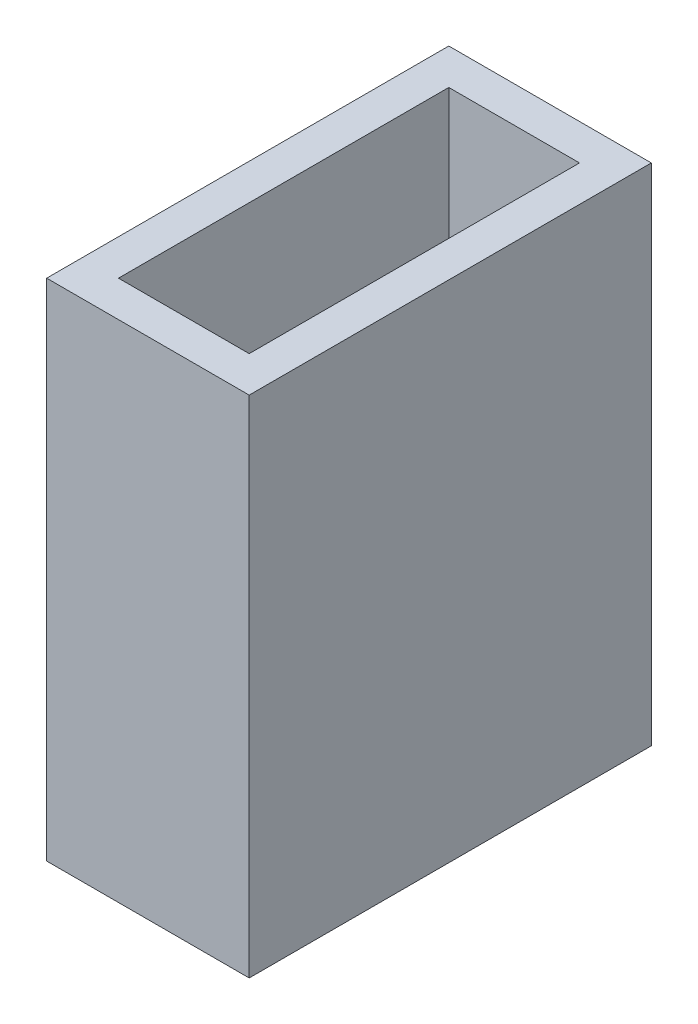
ISO-10303-21;
HEADER;
FILE_DESCRIPTION(('STEP AP214'),'2;1');
FILE_NAME('part.step','',(''),(''),'','','');
FILE_SCHEMA(('AUTOMOTIVE_DESIGN { 1 0 10303 214 1 1 1 1 }'));
ENDSEC;
DATA;
#1=APPLICATION_CONTEXT('core data for automotive mechanical design processes');
#2=APPLICATION_PROTOCOL_DEFINITION('international standard','automotive_design',2000,#1);
#3=PRODUCT_CONTEXT('',#1,'mechanical');
#4=PRODUCT('Part','Part','',(#3));
#5=PRODUCT_RELATED_PRODUCT_CATEGORY('part','',(#4));
#6=PRODUCT_DEFINITION_FORMATION('','',#4);
#7=PRODUCT_DEFINITION_CONTEXT('part definition',#1,'design');
#8=PRODUCT_DEFINITION('design','',#6,#7);
#9=PRODUCT_DEFINITION_SHAPE('','',#8);
#10=(LENGTH_UNIT() NAMED_UNIT(*) SI_UNIT(.MILLI.,.METRE.));
#11=(NAMED_UNIT(*) PLANE_ANGLE_UNIT() SI_UNIT($,.RADIAN.));
#12=(NAMED_UNIT(*) SI_UNIT($,.STERADIAN.) SOLID_ANGLE_UNIT());
#13=UNCERTAINTY_MEASURE_WITH_UNIT(LENGTH_MEASURE(1.E-05),#10,'distance_accuracy_value','');
#14=(GEOMETRIC_REPRESENTATION_CONTEXT(3) GLOBAL_UNCERTAINTY_ASSIGNED_CONTEXT((#13)) GLOBAL_UNIT_ASSIGNED_CONTEXT((#10,
#11,#12)) REPRESENTATION_CONTEXT('',''));
#15=CARTESIAN_POINT('',(0.,0.,0.));
#16=DIRECTION('',(0.,0.,1.));
#17=DIRECTION('',(1.,0.,0.));
#18=AXIS2_PLACEMENT_3D('',#15,#16,#17);
#19=CARTESIAN_POINT('',(14.5262229502912,2.17335897773504,-37.2709017363053));
#20=DIRECTION('',(0.,-1.,0.));
#21=DIRECTION('',(0.,0.,-1.));
#22=AXIS2_PLACEMENT_3D('',#19,#20,#21);
#23=PLANE('',#22);
#24=DIRECTION('',(1.,0.,0.));
#25=VECTOR('',#24,1.);
#26=CARTESIAN_POINT('',(13.7040842537851,2.17335897773504,-35.1934434793238));
#27=LINE('',#26,#25);
#28=CARTESIAN_POINT('',(13.7040842537851,2.17335897773504,-35.1934434793238));
#29=VERTEX_POINT('',#28);
#30=CARTESIAN_POINT('',(15.3483616467974,2.17335897773504,-35.1934434793238));
#31=VERTEX_POINT('',#30);
#32=EDGE_CURVE('E109',#29,#31,#27,.T.);
#33=ORIENTED_EDGE('',*,*,#32,.T.);
#34=DIRECTION('',(0.,0.,-1.));
#35=VECTOR('',#34,1.);
#36=CARTESIAN_POINT('',(15.3483616467974,2.17335897773504,-35.1934434793238));
#37=LINE('',#36,#35);
#38=CARTESIAN_POINT('',(15.3483616467974,2.17335897773504,-39.3483599932868));
#39=VERTEX_POINT('',#38);
#40=EDGE_CURVE('E116',#31,#39,#37,.T.);
#41=ORIENTED_EDGE('',*,*,#40,.T.);
#42=DIRECTION('',(-1.,0.,0.));
#43=VECTOR('',#42,1.);
#44=CARTESIAN_POINT('',(15.3483616467974,2.17335897773504,-39.3483599932868));
#45=LINE('',#44,#43);
#46=CARTESIAN_POINT('',(13.7040842537851,2.17335897773504,-39.3483599932868));
#47=VERTEX_POINT('',#46);
#48=EDGE_CURVE('E130',#39,#47,#45,.T.);
#49=ORIENTED_EDGE('',*,*,#48,.T.);
#50=DIRECTION('',(0.,0.,1.));
#51=VECTOR('',#50,1.);
#52=CARTESIAN_POINT('',(13.7040842537851,2.17335897773504,-39.3483599932868));
#53=LINE('',#52,#51);
#54=EDGE_CURVE('E156',#47,#29,#53,.T.);
#55=ORIENTED_EDGE('',*,*,#54,.T.);
#56=EDGE_LOOP('',(#33,#41,#49,#55));
#57=FACE_BOUND('',#56,.T.);
#58=DIRECTION('',(0.,0.,1.));
#59=VECTOR('',#58,1.);
#60=CARTESIAN_POINT('',(15.7999997114011,2.17335897773504,-34.7418054147201));
#61=LINE('',#60,#59);
#62=CARTESIAN_POINT('',(15.7999997114011,2.17335897773504,-39.7999980578905));
#63=VERTEX_POINT('',#62);
#64=CARTESIAN_POINT('',(15.7999997114011,2.17335897773504,-34.7418054147201));
#65=VERTEX_POINT('',#64);
#66=EDGE_CURVE('E11',#63,#65,#61,.T.);
#67=ORIENTED_EDGE('',*,*,#66,.T.);
#68=DIRECTION('',(-1.,0.,0.));
#69=VECTOR('',#68,1.);
#70=CARTESIAN_POINT('',(13.2524461891814,2.17335897773504,-34.7418054147201));
#71=LINE('',#70,#69);
#72=CARTESIAN_POINT('',(13.2524461891814,2.17335897773504,-34.7418054147201));
#73=VERTEX_POINT('',#72);
#74=EDGE_CURVE('E146',#65,#73,#71,.T.);
#75=ORIENTED_EDGE('',*,*,#74,.T.);
#76=DIRECTION('',(0.,0.,-1.));
#77=VECTOR('',#76,1.);
#78=CARTESIAN_POINT('',(13.2524461891814,2.17335897773504,-39.7999980578905));
#79=LINE('',#78,#77);
#80=CARTESIAN_POINT('',(13.2524461891814,2.17335897773504,-39.7999980578905));
#81=VERTEX_POINT('',#80);
#82=EDGE_CURVE('E157',#73,#81,#79,.T.);
#83=ORIENTED_EDGE('',*,*,#82,.T.);
#84=DIRECTION('',(1.,0.,0.));
#85=VECTOR('',#84,1.);
#86=CARTESIAN_POINT('',(15.7999997114011,2.17335897773504,-39.7999980578905));
#87=LINE('',#86,#85);
#88=EDGE_CURVE('E137',#81,#63,#87,.T.);
#89=ORIENTED_EDGE('',*,*,#88,.T.);
#90=EDGE_LOOP('',(#67,#75,#83,#89));
#91=FACE_BOUND('',#90,.T.);
#92=ADVANCED_FACE('F16',(#57,#91),#23,.T.);
#93=CARTESIAN_POINT('',(14.5262229502912,8.52335897075654,-37.2709017363053));
#94=DIRECTION('',(0.,1.,0.));
#95=DIRECTION('',(1.,0.,0.));
#96=AXIS2_PLACEMENT_3D('',#93,#94,#95);
#97=PLANE('',#96);
#98=DIRECTION('',(1.,0.,0.));
#99=VECTOR('',#98,1.);
#100=CARTESIAN_POINT('',(13.7040842537851,8.52335897075654,-35.1934434793238));
#101=LINE('',#100,#99);
#102=CARTESIAN_POINT('',(13.7040842537851,8.52335897075654,-35.1934434793238));
#103=VERTEX_POINT('',#102);
#104=CARTESIAN_POINT('',(15.3483616467974,8.52335897075654,-35.1934434793238));
#105=VERTEX_POINT('',#104);
#106=EDGE_CURVE('E97',#103,#105,#101,.T.);
#107=ORIENTED_EDGE('',*,*,#106,.F.);
#108=DIRECTION('',(0.,0.,1.));
#109=VECTOR('',#108,1.);
#110=CARTESIAN_POINT('',(13.7040842537851,8.52335897075654,-39.3483599932868));
#111=LINE('',#110,#109);
#112=CARTESIAN_POINT('',(13.7040842537851,8.52335897075654,-39.3483599932868));
#113=VERTEX_POINT('',#112);
#114=EDGE_CURVE('E20',#113,#103,#111,.T.);
#115=ORIENTED_EDGE('',*,*,#114,.F.);
#116=DIRECTION('',(-1.,0.,0.));
#117=VECTOR('',#116,1.);
#118=CARTESIAN_POINT('',(15.3483616467974,8.52335897075654,-39.3483599932868));
#119=LINE('',#118,#117);
#120=CARTESIAN_POINT('',(15.3483616467974,8.52335897075654,-39.3483599932868));
#121=VERTEX_POINT('',#120);
#122=EDGE_CURVE('E122',#121,#113,#119,.T.);
#123=ORIENTED_EDGE('',*,*,#122,.F.);
#124=DIRECTION('',(0.,0.,-1.));
#125=VECTOR('',#124,1.);
#126=CARTESIAN_POINT('',(15.3483616467974,8.52335897075654,-35.1934434793238));
#127=LINE('',#126,#125);
#128=EDGE_CURVE('E114',#105,#121,#127,.T.);
#129=ORIENTED_EDGE('',*,*,#128,.F.);
#130=EDGE_LOOP('',(#107,#115,#123,#129));
#131=FACE_BOUND('',#130,.T.);
#132=DIRECTION('',(0.,0.,-1.));
#133=VECTOR('',#132,1.);
#134=CARTESIAN_POINT('',(15.7999997114011,8.52335897075654,-34.7418054147201));
#135=LINE('',#134,#133);
#136=CARTESIAN_POINT('',(15.7999997114011,8.52335897075654,-34.7418054147201));
#137=VERTEX_POINT('',#136);
#138=CARTESIAN_POINT('',(15.7999997114011,8.52335897075654,-39.7999980578905));
#139=VERTEX_POINT('',#138);
#140=EDGE_CURVE('E27',#137,#139,#135,.T.);
#141=ORIENTED_EDGE('',*,*,#140,.T.);
#142=DIRECTION('',(-1.,0.,0.));
#143=VECTOR('',#142,1.);
#144=CARTESIAN_POINT('',(15.7999997114011,8.52335897075654,-39.7999980578905));
#145=LINE('',#144,#143);
#146=CARTESIAN_POINT('',(13.2524461891814,8.52335897075654,-39.7999980578905));
#147=VERTEX_POINT('',#146);
#148=EDGE_CURVE('E138',#139,#147,#145,.T.);
#149=ORIENTED_EDGE('',*,*,#148,.T.);
#150=DIRECTION('',(0.,0.,1.));
#151=VECTOR('',#150,1.);
#152=CARTESIAN_POINT('',(13.2524461891814,8.52335897075654,-39.7999980578905));
#153=LINE('',#152,#151);
#154=CARTESIAN_POINT('',(13.2524461891814,8.52335897075653,-34.7418054147201));
#155=VERTEX_POINT('',#154);
#156=EDGE_CURVE('E145',#147,#155,#153,.T.);
#157=ORIENTED_EDGE('',*,*,#156,.T.);
#158=DIRECTION('',(1.,0.,0.));
#159=VECTOR('',#158,1.);
#160=CARTESIAN_POINT('',(13.2524461891814,8.52335897075653,-34.7418054147201));
#161=LINE('',#160,#159);
#162=EDGE_CURVE('E150',#155,#137,#161,.T.);
#163=ORIENTED_EDGE('',*,*,#162,.T.);
#164=EDGE_LOOP('',(#141,#149,#157,#163));
#165=FACE_BOUND('',#164,.T.);
#166=ADVANCED_FACE('F120',(#131,#165),#97,.T.);
#167=CARTESIAN_POINT('',(15.7999997114011,8.52335897075654,-39.7999980578905));
#168=DIRECTION('',(1.,0.,0.));
#169=DIRECTION('',(0.,1.,0.));
#170=AXIS2_PLACEMENT_3D('',#167,#168,#169);
#171=PLANE('',#170);
#172=ORIENTED_EDGE('',*,*,#140,.F.);
#173=DIRECTION('',(0.,-1.,0.));
#174=VECTOR('',#173,1.);
#175=CARTESIAN_POINT('',(15.7999997114011,8.52335897075654,-34.7418054147201));
#176=LINE('',#175,#174);
#177=EDGE_CURVE('E149',#137,#65,#176,.T.);
#178=ORIENTED_EDGE('',*,*,#177,.T.);
#179=ORIENTED_EDGE('',*,*,#66,.F.);
#180=DIRECTION('',(0.,-1.,0.));
#181=VECTOR('',#180,1.);
#182=CARTESIAN_POINT('',(15.7999997114011,8.52335897075654,-39.7999980578905));
#183=LINE('',#182,#181);
#184=EDGE_CURVE('E133',#139,#63,#183,.T.);
#185=ORIENTED_EDGE('',*,*,#184,.F.);
#186=EDGE_LOOP('',(#172,#178,#179,#185));
#187=FACE_BOUND('',#186,.T.);
#188=ADVANCED_FACE('F212',(#187),#171,.T.);
#189=CARTESIAN_POINT('',(15.7999997114011,8.52335897075654,-34.7418054147201));
#190=DIRECTION('',(0.,0.,1.));
#191=DIRECTION('',(1.,0.,0.));
#192=AXIS2_PLACEMENT_3D('',#189,#190,#191);
#193=PLANE('',#192);
#194=ORIENTED_EDGE('',*,*,#162,.F.);
#195=DIRECTION('',(0.,-1.,0.));
#196=VECTOR('',#195,1.);
#197=CARTESIAN_POINT('',(13.2524461891814,8.52335897075653,-34.7418054147201));
#198=LINE('',#197,#196);
#199=EDGE_CURVE('E160',#155,#73,#198,.T.);
#200=ORIENTED_EDGE('',*,*,#199,.T.);
#201=ORIENTED_EDGE('',*,*,#74,.F.);
#202=ORIENTED_EDGE('',*,*,#177,.F.);
#203=EDGE_LOOP('',(#194,#200,#201,#202));
#204=FACE_BOUND('',#203,.T.);
#205=ADVANCED_FACE('F204',(#204),#193,.T.);
#206=CARTESIAN_POINT('',(13.2524461891814,8.52335897075654,-34.7418054147201));
#207=DIRECTION('',(-1.,0.,0.));
#208=DIRECTION('',(0.,1.,0.));
#209=AXIS2_PLACEMENT_3D('',#206,#207,#208);
#210=PLANE('',#209);
#211=ORIENTED_EDGE('',*,*,#156,.F.);
#212=DIRECTION('',(0.,-1.,0.));
#213=VECTOR('',#212,1.);
#214=CARTESIAN_POINT('',(13.2524461891814,8.52335897075654,-39.7999980578905));
#215=LINE('',#214,#213);
#216=EDGE_CURVE('E141',#147,#81,#215,.T.);
#217=ORIENTED_EDGE('',*,*,#216,.T.);
#218=ORIENTED_EDGE('',*,*,#82,.F.);
#219=ORIENTED_EDGE('',*,*,#199,.F.);
#220=EDGE_LOOP('',(#211,#217,#218,#219));
#221=FACE_BOUND('',#220,.T.);
#222=ADVANCED_FACE('F206',(#221),#210,.T.);
#223=CARTESIAN_POINT('',(13.2524461891814,8.52335897075653,-39.7999980578905));
#224=DIRECTION('',(0.,0.,-1.));
#225=DIRECTION('',(0.,-1.,0.));
#226=AXIS2_PLACEMENT_3D('',#223,#224,#225);
#227=PLANE('',#226);
#228=ORIENTED_EDGE('',*,*,#148,.F.);
#229=ORIENTED_EDGE('',*,*,#184,.T.);
#230=ORIENTED_EDGE('',*,*,#88,.F.);
#231=ORIENTED_EDGE('',*,*,#216,.F.);
#232=EDGE_LOOP('',(#228,#229,#230,#231));
#233=FACE_BOUND('',#232,.T.);
#234=ADVANCED_FACE('F210',(#233),#227,.T.);
#235=CARTESIAN_POINT('',(13.7040842537851,8.52335897075654,-35.1934434793238));
#236=DIRECTION('',(0.,0.,-1.));
#237=DIRECTION('',(0.,-1.,0.));
#238=AXIS2_PLACEMENT_3D('',#235,#236,#237);
#239=PLANE('',#238);
#240=ORIENTED_EDGE('',*,*,#106,.T.);
#241=DIRECTION('',(0.,-1.,0.));
#242=VECTOR('',#241,1.);
#243=CARTESIAN_POINT('',(15.3483616467974,8.52335897075654,-35.1934434793238));
#244=LINE('',#243,#242);
#245=EDGE_CURVE('E100',#105,#31,#244,.T.);
#246=ORIENTED_EDGE('',*,*,#245,.T.);
#247=ORIENTED_EDGE('',*,*,#32,.F.);
#248=DIRECTION('',(0.,-1.,0.));
#249=VECTOR('',#248,1.);
#250=CARTESIAN_POINT('',(13.7040842537851,8.52335897075654,-35.1934434793238));
#251=LINE('',#250,#249);
#252=EDGE_CURVE('E103',#103,#29,#251,.T.);
#253=ORIENTED_EDGE('',*,*,#252,.F.);
#254=EDGE_LOOP('',(#240,#246,#247,#253));
#255=FACE_BOUND('',#254,.T.);
#256=ADVANCED_FACE('F99',(#255),#239,.T.);
#257=CARTESIAN_POINT('',(15.3483616467974,8.52335897075654,-35.1934434793238));
#258=DIRECTION('',(-1.,0.,0.));
#259=DIRECTION('',(0.,1.,0.));
#260=AXIS2_PLACEMENT_3D('',#257,#258,#259);
#261=PLANE('',#260);
#262=ORIENTED_EDGE('',*,*,#128,.T.);
#263=DIRECTION('',(0.,-1.,0.));
#264=VECTOR('',#263,1.);
#265=CARTESIAN_POINT('',(15.3483616467974,8.52335897075654,-39.3483599932868));
#266=LINE('',#265,#264);
#267=EDGE_CURVE('E124',#121,#39,#266,.T.);
#268=ORIENTED_EDGE('',*,*,#267,.T.);
#269=ORIENTED_EDGE('',*,*,#40,.F.);
#270=ORIENTED_EDGE('',*,*,#245,.F.);
#271=EDGE_LOOP('',(#262,#268,#269,#270));
#272=FACE_BOUND('',#271,.T.);
#273=ADVANCED_FACE('F112',(#272),#261,.T.);
#274=CARTESIAN_POINT('',(15.3483616467974,8.52335897075654,-39.3483599932868));
#275=DIRECTION('',(0.,0.,1.));
#276=DIRECTION('',(1.,0.,0.));
#277=AXIS2_PLACEMENT_3D('',#274,#275,#276);
#278=PLANE('',#277);
#279=ORIENTED_EDGE('',*,*,#122,.T.);
#280=DIRECTION('',(0.,-1.,0.));
#281=VECTOR('',#280,1.);
#282=CARTESIAN_POINT('',(13.7040842537851,8.52335897075654,-39.3483599932868));
#283=LINE('',#282,#281);
#284=EDGE_CURVE('E153',#113,#47,#283,.T.);
#285=ORIENTED_EDGE('',*,*,#284,.T.);
#286=ORIENTED_EDGE('',*,*,#48,.F.);
#287=ORIENTED_EDGE('',*,*,#267,.F.);
#288=EDGE_LOOP('',(#279,#285,#286,#287));
#289=FACE_BOUND('',#288,.T.);
#290=ADVANCED_FACE('F283',(#289),#278,.T.);
#291=CARTESIAN_POINT('',(13.7040842537851,8.52335897075654,-39.3483599932868));
#292=DIRECTION('',(1.,0.,0.));
#293=DIRECTION('',(0.,1.,0.));
#294=AXIS2_PLACEMENT_3D('',#291,#292,#293);
#295=PLANE('',#294);
#296=ORIENTED_EDGE('',*,*,#114,.T.);
#297=ORIENTED_EDGE('',*,*,#252,.T.);
#298=ORIENTED_EDGE('',*,*,#54,.F.);
#299=ORIENTED_EDGE('',*,*,#284,.F.);
#300=EDGE_LOOP('',(#296,#297,#298,#299));
#301=FACE_BOUND('',#300,.T.);
#302=ADVANCED_FACE('F18',(#301),#295,.T.);
#303=CLOSED_SHELL('',(#92,#166,#188,#205,#222,#234,#256,#273,#290,#302));
#304=MANIFOLD_SOLID_BREP('B1',#303);
#305=ADVANCED_BREP_SHAPE_REPRESENTATION('',(#18,#304),#14);
#306=SHAPE_DEFINITION_REPRESENTATION(#9,#305);
ENDSEC;
END-ISO-10303-21;
